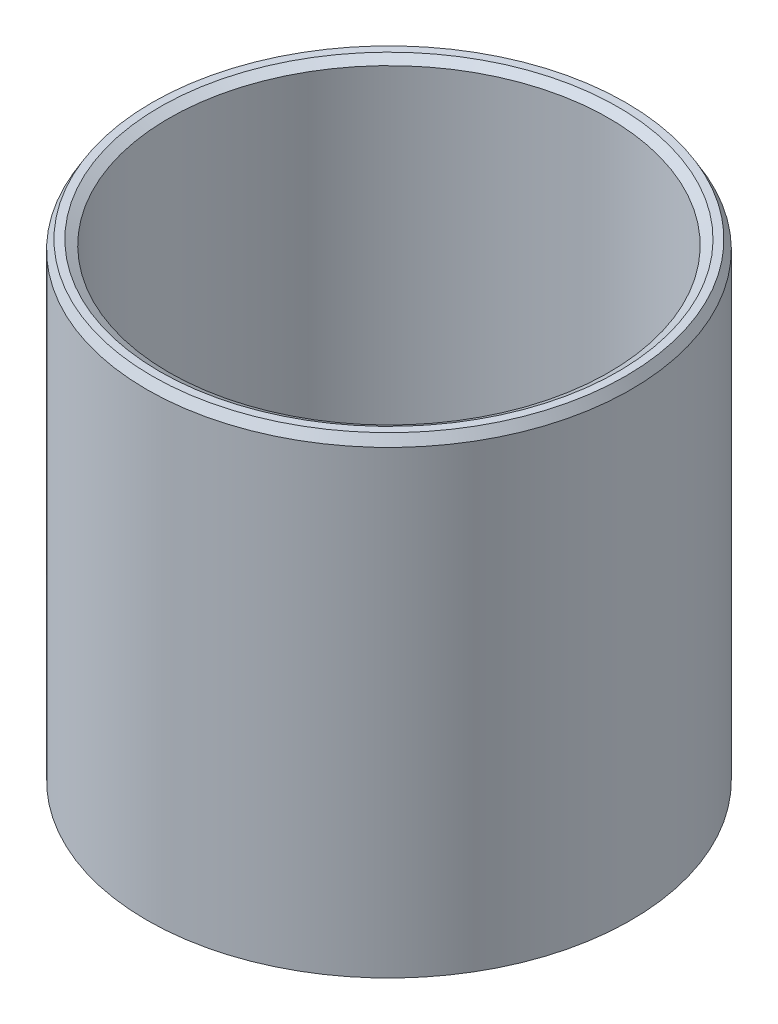
ISO-10303-21;
HEADER;
FILE_DESCRIPTION(('STEP AP214'),'2;1');
FILE_NAME('part.step','',(''),(''),'','','');
FILE_SCHEMA(('AUTOMOTIVE_DESIGN { 1 0 10303 214 1 1 1 1 }'));
ENDSEC;
DATA;
#1=APPLICATION_CONTEXT('core data for automotive mechanical design processes');
#2=APPLICATION_PROTOCOL_DEFINITION('international standard','automotive_design',2000,#1);
#3=PRODUCT_CONTEXT('',#1,'mechanical');
#4=PRODUCT('Part','Part','',(#3));
#5=PRODUCT_RELATED_PRODUCT_CATEGORY('part','',(#4));
#6=PRODUCT_DEFINITION_FORMATION('','',#4);
#7=PRODUCT_DEFINITION_CONTEXT('part definition',#1,'design');
#8=PRODUCT_DEFINITION('design','',#6,#7);
#9=PRODUCT_DEFINITION_SHAPE('','',#8);
#10=(LENGTH_UNIT() NAMED_UNIT(*) SI_UNIT(.MILLI.,.METRE.));
#11=(NAMED_UNIT(*) PLANE_ANGLE_UNIT() SI_UNIT($,.RADIAN.));
#12=(NAMED_UNIT(*) SI_UNIT($,.STERADIAN.) SOLID_ANGLE_UNIT());
#13=UNCERTAINTY_MEASURE_WITH_UNIT(LENGTH_MEASURE(1.E-05),#10,'distance_accuracy_value','');
#14=(GEOMETRIC_REPRESENTATION_CONTEXT(3) GLOBAL_UNCERTAINTY_ASSIGNED_CONTEXT((#13)) GLOBAL_UNIT_ASSIGNED_CONTEXT((#10,
#11,#12)) REPRESENTATION_CONTEXT('',''));
#15=CARTESIAN_POINT('',(0.,0.,0.));
#16=DIRECTION('',(0.,0.,1.));
#17=DIRECTION('',(1.,0.,0.));
#18=AXIS2_PLACEMENT_3D('',#15,#16,#17);
#19=CARTESIAN_POINT('',(0.,107.64032081435,0.));
#20=DIRECTION('',(0.,-1.,0.));
#21=DIRECTION('',(0.,0.,-1.));
#22=AXIS2_PLACEMENT_3D('',#19,#20,#21);
#23=CYLINDRICAL_SURFACE('',#22,55.);
#24=CARTESIAN_POINT('',(0.,1.1913957796432,0.));
#25=DIRECTION('',(0.,1.,0.));
#26=DIRECTION('',(0.,0.,1.));
#27=AXIS2_PLACEMENT_3D('',#24,#25,#26);
#28=CIRCLE('',#27,55.);
#29=CARTESIAN_POINT('',(0.,1.19139577964319,55.));
#30=VERTEX_POINT('',#29);
#31=EDGE_CURVE('E10',#30,#30,#28,.T.);
#32=ORIENTED_EDGE('',*,*,#31,.T.);
#33=EDGE_LOOP('',(#32));
#34=FACE_BOUND('',#33,.T.);
#35=CARTESIAN_POINT('',(0.,105.576762792085,0.));
#36=DIRECTION('',(0.,1.,0.));
#37=DIRECTION('',(0.,0.,1.));
#38=AXIS2_PLACEMENT_3D('',#35,#36,#37);
#39=CIRCLE('',#38,55.);
#40=CARTESIAN_POINT('',(0.,105.576762792085,55.));
#41=VERTEX_POINT('',#40);
#42=EDGE_CURVE('E50',#41,#41,#39,.F.);
#43=ORIENTED_EDGE('',*,*,#42,.T.);
#44=EDGE_LOOP('',(#43));
#45=FACE_BOUND('',#44,.T.);
#46=ADVANCED_FACE('F39',(#34,#45),#23,.T.);
#47=CARTESIAN_POINT('',(0.,107.64032081435,0.));
#48=DIRECTION('',(0.,1.,0.));
#49=DIRECTION('',(0.,0.,1.));
#50=AXIS2_PLACEMENT_3D('',#47,#48,#49);
#51=PLANE('',#50);
#52=CARTESIAN_POINT('',(0.,107.64032081435,0.));
#53=DIRECTION('',(0.,1.,0.));
#54=DIRECTION('',(0.,0.,1.));
#55=AXIS2_PLACEMENT_3D('',#52,#53,#54);
#56=CIRCLE('',#55,52.0592145502116);
#57=CARTESIAN_POINT('',(0.,107.64032081435,52.0592145502116));
#58=VERTEX_POINT('',#57);
#59=EDGE_CURVE('E58',#58,#58,#56,.F.);
#60=ORIENTED_EDGE('',*,*,#59,.T.);
#61=EDGE_LOOP('',(#60));
#62=FACE_BOUND('',#61,.T.);
#63=CARTESIAN_POINT('',(0.,107.64032081435,0.));
#64=DIRECTION('',(0.,1.,0.));
#65=DIRECTION('',(0.,0.,1.));
#66=AXIS2_PLACEMENT_3D('',#63,#64,#65);
#67=CIRCLE('',#66,53.8086042203568);
#68=CARTESIAN_POINT('',(0.,107.64032081435,53.8086042203568));
#69=VERTEX_POINT('',#68);
#70=EDGE_CURVE('E61',#69,#69,#67,.T.);
#71=ORIENTED_EDGE('',*,*,#70,.T.);
#72=EDGE_LOOP('',(#71));
#73=FACE_BOUND('',#72,.T.);
#74=ADVANCED_FACE('F88',(#62,#73),#51,.T.);
#75=CARTESIAN_POINT('',(0.,0.,0.));
#76=DIRECTION('',(0.,1.,0.));
#77=DIRECTION('',(0.,0.,1.));
#78=AXIS2_PLACEMENT_3D('',#75,#76,#77);
#79=PLANE('',#78);
#80=CARTESIAN_POINT('',(0.,0.,0.));
#81=DIRECTION('',(0.,1.,0.));
#82=DIRECTION('',(0.,0.,1.));
#83=AXIS2_PLACEMENT_3D('',#80,#81,#82);
#84=CIRCLE('',#83,51.1870523075897);
#85=CARTESIAN_POINT('',(0.,0.,51.1870523075897));
#86=VERTEX_POINT('',#85);
#87=EDGE_CURVE('E51',#86,#86,#84,.T.);
#88=ORIENTED_EDGE('',*,*,#87,.T.);
#89=EDGE_LOOP('',(#88));
#90=FACE_BOUND('',#89,.T.);
#91=CARTESIAN_POINT('',(0.,0.,0.));
#92=DIRECTION('',(0.,1.,0.));
#93=DIRECTION('',(0.,0.,1.));
#94=AXIS2_PLACEMENT_3D('',#91,#92,#93);
#95=CIRCLE('',#94,52.9364419777349);
#96=CARTESIAN_POINT('',(0.,0.,52.9364419777349));
#97=VERTEX_POINT('',#96);
#98=EDGE_CURVE('E54',#97,#97,#95,.F.);
#99=ORIENTED_EDGE('',*,*,#98,.T.);
#100=EDGE_LOOP('',(#99));
#101=FACE_BOUND('',#100,.T.);
#102=ADVANCED_FACE('F83',(#90,#101),#79,.F.);
#103=CARTESIAN_POINT('',(0.,107.64032081435,0.));
#104=DIRECTION('',(0.,-1.,0.));
#105=DIRECTION('',(0.,0.,-1.));
#106=AXIS2_PLACEMENT_3D('',#103,#104,#105);
#107=CYLINDRICAL_SURFACE('',#106,49.9956565279465);
#108=CARTESIAN_POINT('',(0.,106.448925034707,0.));
#109=DIRECTION('',(0.,1.,0.));
#110=DIRECTION('',(0.,0.,1.));
#111=AXIS2_PLACEMENT_3D('',#108,#109,#110);
#112=CIRCLE('',#111,49.9956565279465);
#113=CARTESIAN_POINT('',(0.,106.448925034707,49.9956565279465));
#114=VERTEX_POINT('',#113);
#115=EDGE_CURVE('E67',#114,#114,#112,.T.);
#116=ORIENTED_EDGE('',*,*,#115,.T.);
#117=EDGE_LOOP('',(#116));
#118=FACE_BOUND('',#117,.T.);
#119=CARTESIAN_POINT('',(0.,2.06355802226514,0.));
#120=DIRECTION('',(0.,1.,0.));
#121=DIRECTION('',(0.,0.,1.));
#122=AXIS2_PLACEMENT_3D('',#119,#120,#121);
#123=CIRCLE('',#122,49.9956565279465);
#124=CARTESIAN_POINT('',(0.,2.06355802226514,49.9956565279465));
#125=VERTEX_POINT('',#124);
#126=EDGE_CURVE('E69',#125,#125,#123,.F.);
#127=ORIENTED_EDGE('',*,*,#126,.T.);
#128=EDGE_LOOP('',(#127));
#129=FACE_BOUND('',#128,.T.);
#130=ADVANCED_FACE('F71',(#118,#129),#107,.F.);
#131=CARTESIAN_POINT('',(0.,106.448925034707,0.));
#132=DIRECTION('',(0.,1.,0.));
#133=DIRECTION('',(0.,0.,1.));
#134=AXIS2_PLACEMENT_3D('',#131,#132,#133);
#135=CONICAL_SURFACE('',#134,49.9956565279465,1.04719755119661);
#136=CARTESIAN_POINT('',(0.,107.64032081435,52.0592145502116));
#137=CARTESIAN_POINT('',(0.,107.627910441645,52.0377191541463));
#138=CARTESIAN_POINT('',(0.,107.615500068941,52.0162237580811));
#139=CARTESIAN_POINT('',(0.,107.590679323532,51.9732329659506));
#140=CARTESIAN_POINT('',(0.,107.578268950827,51.9517375698853));
#141=CARTESIAN_POINT('',(0.,107.553448205418,51.9087467777548));
#142=CARTESIAN_POINT('',(0.,107.541037832713,51.8872513816895));
#143=CARTESIAN_POINT('',(0.,107.516217087304,51.844260589559));
#144=CARTESIAN_POINT('',(0.,107.503806714599,51.8227651934937));
#145=CARTESIAN_POINT('',(0.,107.47898596919,51.7797744013632));
#146=CARTESIAN_POINT('',(0.,107.466575596485,51.758279005298));
#147=CARTESIAN_POINT('',(0.,107.441754851076,51.7152882131674));
#148=CARTESIAN_POINT('',(0.,107.429344478371,51.6937928171022));
#149=CARTESIAN_POINT('',(0.,107.404523732962,51.6508020249716));
#150=CARTESIAN_POINT('',(0.,107.392113360258,51.6293066289064));
#151=CARTESIAN_POINT('',(0.,107.367292614848,51.5863158367759));
#152=CARTESIAN_POINT('',(0.,107.354882242144,51.5648204407106));
#153=CARTESIAN_POINT('',(0.,107.330061496735,51.5218296485801));
#154=CARTESIAN_POINT('',(0.,107.31765112403,51.5003342525148));
#155=CARTESIAN_POINT('',(0.,107.292830378621,51.4573434603843));
#156=CARTESIAN_POINT('',(0.,107.280420005916,51.435848064319));
#157=CARTESIAN_POINT('',(0.,107.255599260507,51.3928572721885));
#158=CARTESIAN_POINT('',(0.,107.243188887802,51.3713618761232));
#159=CARTESIAN_POINT('',(0.,107.218368142393,51.3283710839927));
#160=CARTESIAN_POINT('',(0.,107.205957769688,51.3068756879275));
#161=CARTESIAN_POINT('',(0.,107.181137024279,51.2638848957969));
#162=CARTESIAN_POINT('',(0.,107.168726651575,51.2423894997317));
#163=CARTESIAN_POINT('',(0.,107.143905906165,51.1993987076011));
#164=CARTESIAN_POINT('',(0.,107.131495533461,51.1779033115359));
#165=CARTESIAN_POINT('',(0.,107.106674788051,51.1349125194054));
#166=CARTESIAN_POINT('',(0.,107.094264415347,51.1134171233401));
#167=CARTESIAN_POINT('',(0.,107.069443669938,51.0704263312096));
#168=CARTESIAN_POINT('',(0.,107.057033297233,51.0489309351443));
#169=CARTESIAN_POINT('',(0.,107.032212551824,51.0059401430138));
#170=CARTESIAN_POINT('',(0.,107.019802179119,50.9844447469485));
#171=CARTESIAN_POINT('',(0.,106.99498143371,50.941453954818));
#172=CARTESIAN_POINT('',(0.,106.982571061005,50.9199585587527));
#173=CARTESIAN_POINT('',(0.,106.957750315596,50.8769677666222));
#174=CARTESIAN_POINT('',(0.,106.945339942891,50.855472370557));
#175=CARTESIAN_POINT('',(0.,106.920519197482,50.8124815784264));
#176=CARTESIAN_POINT('',(0.,106.908108824778,50.7909861823612));
#177=CARTESIAN_POINT('',(0.,106.883288079368,50.7479953902307));
#178=CARTESIAN_POINT('',(0.,106.870877706664,50.7264999941654));
#179=CARTESIAN_POINT('',(0.,106.846056961255,50.6835092020349));
#180=CARTESIAN_POINT('',(0.,106.83364658855,50.6620138059696));
#181=CARTESIAN_POINT('',(0.,106.808825843141,50.6190230138391));
#182=CARTESIAN_POINT('',(0.,106.796415470436,50.5975276177738));
#183=CARTESIAN_POINT('',(0.,106.771594725027,50.5545368256433));
#184=CARTESIAN_POINT('',(0.,106.759184352322,50.533041429578));
#185=CARTESIAN_POINT('',(0.,106.734363606913,50.4900506374475));
#186=CARTESIAN_POINT('',(0.,106.721953234208,50.4685552413823));
#187=CARTESIAN_POINT('',(0.,106.697132488799,50.4255644492517));
#188=CARTESIAN_POINT('',(0.,106.684722116095,50.4040690531865));
#189=CARTESIAN_POINT('',(0.,106.659901370685,50.3610782610559));
#190=CARTESIAN_POINT('',(0.,106.647490997981,50.3395828649907));
#191=CARTESIAN_POINT('',(0.,106.622670252571,50.2965920728602));
#192=CARTESIAN_POINT('',(0.,106.610259879867,50.2750966767949));
#193=CARTESIAN_POINT('',(0.,106.585439134458,50.2321058846644));
#194=CARTESIAN_POINT('',(0.,106.573028761753,50.2106104885991));
#195=CARTESIAN_POINT('',(0.,106.548208016344,50.1676196964686));
#196=CARTESIAN_POINT('',(0.,106.535797643639,50.1461243004033));
#197=CARTESIAN_POINT('',(0.,106.51097689823,50.1031335082728));
#198=CARTESIAN_POINT('',(0.,106.498566525525,50.0816381122075));
#199=CARTESIAN_POINT('',(0.,106.473745780116,50.038647320077));
#200=CARTESIAN_POINT('',(0.,106.461335407411,50.0171519240118));
#201=CARTESIAN_POINT('',(0.,106.448925034707,49.9956565279465));
#202=B_SPLINE_CURVE_WITH_KNOTS('',3,(#136,#137,#138,#139,#140,#141,#142,#143,#144,#145,#146,
#147,#148,#149,#150,#151,#152,#153,#154,#155,#156,#157,#158,#159,#160,#161,#162,#163,#164,#165,
#166,#167,#168,#169,#170,#171,#172,#173,#174,#175,#176,#177,#178,#179,#180,#181,#182,#183,#184,
#185,#186,#187,#188,#189,#190,#191,#192,#193,#194,#195,#196,#197,#198,#199,#200,#201),
.UNSPECIFIED.,.F.,.F.,(4,2,2,2,2,2,2,2,2,2,2,2,2,2,2,2,2,2,2,2,2,2,2,2,2,2,2,2,2,2,2,2,4),(0.,
0.0744622362276958,0.148924472455398,0.223386708683093,0.297848944910795,0.372311181138491,
0.446773417366186,0.521235653593882,0.595697889821584,0.670160126049279,0.744622362276981,
0.819084598504676,0.893546834732372,0.968009070960074,1.04247130718777,1.11693354341547,
1.19139577964316,1.26585801587086,1.34032025209856,1.41478248832626,1.48924472455396,
1.56370696078166,1.63816919700935,1.71263143323705,1.78709366946474,1.86155590569245,
1.93601814192015,2.01048037814784,2.08494261437554,2.15940485060323,2.23386708683094,
2.30832932305863,2.38279155928633),.UNSPECIFIED.);
#203=EDGE_CURVE('BSEAM77',#58,#114,#202,.T.);
#204=ORIENTED_EDGE('',*,*,#59,.F.);
#205=ORIENTED_EDGE('',*,*,#115,.F.);
#206=ORIENTED_EDGE('',*,*,#203,.T.);
#207=ORIENTED_EDGE('',*,*,#203,.F.);
#208=EDGE_LOOP('',(#204,#206,#205,#207));
#209=FACE_BOUND('',#208,.T.);
#210=ADVANCED_FACE('F77',(#209),#135,.F.);
#211=CARTESIAN_POINT('',(0.,0.,0.));
#212=DIRECTION('',(0.,-1.,0.));
#213=DIRECTION('',(0.,0.,-1.));
#214=AXIS2_PLACEMENT_3D('',#211,#212,#213);
#215=CONICAL_SURFACE('',#214,51.1870523075897,0.523598775598298);
#216=ORIENTED_EDGE('',*,*,#126,.F.);
#217=EDGE_LOOP('',(#216));
#218=FACE_BOUND('',#217,.T.);
#219=ORIENTED_EDGE('',*,*,#87,.F.);
#220=EDGE_LOOP('',(#219));
#221=FACE_BOUND('',#220,.T.);
#222=ADVANCED_FACE('F73',(#218,#221),#215,.F.);
#223=CARTESIAN_POINT('',(0.,1.1913957796432,0.));
#224=DIRECTION('',(0.,1.,0.));
#225=DIRECTION('',(0.,0.,1.));
#226=AXIS2_PLACEMENT_3D('',#223,#224,#225);
#227=CONICAL_SURFACE('',#226,55.,1.0471975511966);
#228=CARTESIAN_POINT('',(0.,0.,52.9364419777349));
#229=CARTESIAN_POINT('',(0.,0.012410372704615,52.9579373738001));
#230=CARTESIAN_POINT('',(0.,0.0248207454092321,52.9794327698654));
#231=CARTESIAN_POINT('',(0.,0.0496414908184662,53.0224235619959));
#232=CARTESIAN_POINT('',(0.,0.0620518635230833,53.0439189580612));
#233=CARTESIAN_POINT('',(0.,0.0868726089323167,53.0869097501917));
#234=CARTESIAN_POINT('',(0.,0.099282981636933,53.108405146257));
#235=CARTESIAN_POINT('',(0.,0.124103727046166,53.1513959383875));
#236=CARTESIAN_POINT('',(0.,0.136514099750782,53.1728913344527));
#237=CARTESIAN_POINT('',(0.,0.161334845160015,53.2158821265833));
#238=CARTESIAN_POINT('',(0.,0.173745217864633,53.2373775226485));
#239=CARTESIAN_POINT('',(0.,0.198565963273866,53.280368314779));
#240=CARTESIAN_POINT('',(0.,0.210976335978483,53.3018637108443));
#241=CARTESIAN_POINT('',(0.,0.235797081387715,53.3448545029748));
#242=CARTESIAN_POINT('',(0.,0.248207454092331,53.3663498990401));
#243=CARTESIAN_POINT('',(0.,0.273028199501565,53.4093406911706));
#244=CARTESIAN_POINT('',(0.,0.285438572206182,53.4308360872359));
#245=CARTESIAN_POINT('',(0.,0.310259317615416,53.4738268793664));
#246=CARTESIAN_POINT('',(0.,0.322669690320032,53.4953222754317));
#247=CARTESIAN_POINT('',(0.,0.347490435729265,53.5383130675622));
#248=CARTESIAN_POINT('',(0.,0.359900808433881,53.5598084636275));
#249=CARTESIAN_POINT('',(0.,0.384721553843114,53.602799255758));
#250=CARTESIAN_POINT('',(0.,0.397131926547732,53.6242946518232));
#251=CARTESIAN_POINT('',(0.,0.421952671956965,53.6672854439538));
#252=CARTESIAN_POINT('',(0.,0.434363044661581,53.688780840019));
#253=CARTESIAN_POINT('',(0.,0.459183790070814,53.7317716321495));
#254=CARTESIAN_POINT('',(0.,0.471594162775431,53.7532670282148));
#255=CARTESIAN_POINT('',(0.,0.496414908184664,53.7962578203453));
#256=CARTESIAN_POINT('',(0.,0.50882528088928,53.8177532164106));
#257=CARTESIAN_POINT('',(0.,0.533646026298514,53.8607440085411));
#258=CARTESIAN_POINT('',(0.,0.546056399003131,53.8822394046064));
#259=CARTESIAN_POINT('',(0.,0.570877144412365,53.9252301967369));
#260=CARTESIAN_POINT('',(0.,0.583287517116981,53.9467255928022));
#261=CARTESIAN_POINT('',(0.,0.608108262526214,53.9897163849327));
#262=CARTESIAN_POINT('',(0.,0.62051863523083,54.011211780998));
#263=CARTESIAN_POINT('',(0.,0.645339380640063,54.0542025731285));
#264=CARTESIAN_POINT('',(0.,0.657749753344681,54.0756979691937));
#265=CARTESIAN_POINT('',(0.,0.682570498753914,54.1186887613243));
#266=CARTESIAN_POINT('',(0.,0.69498087145853,54.1401841573895));
#267=CARTESIAN_POINT('',(0.,0.719801616867763,54.18317494952));
#268=CARTESIAN_POINT('',(0.,0.732211989572379,54.2046703455853));
#269=CARTESIAN_POINT('',(0.,0.757032734981613,54.2476611377158));
#270=CARTESIAN_POINT('',(0.,0.76944310768623,54.2691565337811));
#271=CARTESIAN_POINT('',(0.,0.794263853095464,54.3121473259116));
#272=CARTESIAN_POINT('',(0.,0.80667422580008,54.3336427219769));
#273=CARTESIAN_POINT('',(0.,0.831494971209313,54.3766335141074));
#274=CARTESIAN_POINT('',(0.,0.843905343913929,54.3981289101727));
#275=CARTESIAN_POINT('',(0.,0.868726089323163,54.4411197023032));
#276=CARTESIAN_POINT('',(0.,0.88113646202778,54.4626150983685));
#277=CARTESIAN_POINT('',(0.,0.905957207437013,54.505605890499));
#278=CARTESIAN_POINT('',(0.,0.918367580141629,54.5271012865642));
#279=CARTESIAN_POINT('',(0.,0.943188325550863,54.5700920786948));
#280=CARTESIAN_POINT('',(0.,0.955598698255479,54.59158747476));
#281=CARTESIAN_POINT('',(0.,0.980419443664712,54.6345782668905));
#282=CARTESIAN_POINT('',(0.,0.992829816369328,54.6560736629558));
#283=CARTESIAN_POINT('',(0.,1.01765056177856,54.6990644550863));
#284=CARTESIAN_POINT('',(0.,1.03006093448318,54.7205598511516));
#285=CARTESIAN_POINT('',(0.,1.05488167989241,54.7635506432821));
#286=CARTESIAN_POINT('',(0.,1.06729205259703,54.7850460393474));
#287=CARTESIAN_POINT('',(0.,1.09211279800626,54.8280368314779));
#288=CARTESIAN_POINT('',(0.,1.10452317071088,54.8495322275432));
#289=CARTESIAN_POINT('',(0.,1.12934391612011,54.8925230196737));
#290=CARTESIAN_POINT('',(0.,1.14175428882473,54.914018415739));
#291=CARTESIAN_POINT('',(0.,1.16657503423396,54.9570092078695));
#292=CARTESIAN_POINT('',(0.,1.17898540693858,54.9785046039347));
#293=CARTESIAN_POINT('',(0.,1.19139577964319,55.));
#294=B_SPLINE_CURVE_WITH_KNOTS('',3,(#228,#229,#230,#231,#232,#233,#234,#235,#236,#237,#238,
#239,#240,#241,#242,#243,#244,#245,#246,#247,#248,#249,#250,#251,#252,#253,#254,#255,#256,#257,
#258,#259,#260,#261,#262,#263,#264,#265,#266,#267,#268,#269,#270,#271,#272,#273,#274,#275,#276,
#277,#278,#279,#280,#281,#282,#283,#284,#285,#286,#287,#288,#289,#290,#291,#292,#293),
.UNSPECIFIED.,.F.,.F.,(4,2,2,2,2,2,2,2,2,2,2,2,2,2,2,2,2,2,2,2,2,2,2,2,2,2,2,2,2,2,2,2,4),(0.,
0.0744622362277014,0.148924472455397,0.223386708683098,0.2978489449108,0.372311181138495,
0.446773417366196,0.521235653593898,0.595697889821593,0.670160126049294,0.744622362276996,
0.819084598504691,0.893546834732393,0.968009070960094,1.0424713071878,1.11693354341549,
1.19139577964319,1.26585801587089,1.34032025209859,1.41478248832629,1.48924472455399,
1.56370696078169,1.63816919700939,1.71263143323709,1.78709366946479,1.86155590569249,
1.93601814192019,2.01048037814789,2.08494261437558,2.15940485060329,2.23386708683099,
2.30832932305868,2.38279155928638),.UNSPECIFIED.);
#295=EDGE_CURVE('BSEAM76',#97,#30,#294,.T.);
#296=ORIENTED_EDGE('',*,*,#98,.F.);
#297=ORIENTED_EDGE('',*,*,#31,.F.);
#298=ORIENTED_EDGE('',*,*,#295,.T.);
#299=ORIENTED_EDGE('',*,*,#295,.F.);
#300=EDGE_LOOP('',(#296,#298,#297,#299));
#301=FACE_BOUND('',#300,.T.);
#302=ADVANCED_FACE('F76',(#301),#227,.T.);
#303=CARTESIAN_POINT('',(0.,107.64032081435,0.));
#304=DIRECTION('',(0.,-1.,0.));
#305=DIRECTION('',(0.,0.,-1.));
#306=AXIS2_PLACEMENT_3D('',#303,#304,#305);
#307=CONICAL_SURFACE('',#306,53.8086042203568,0.523598775598302);
#308=ORIENTED_EDGE('',*,*,#42,.F.);
#309=EDGE_LOOP('',(#308));
#310=FACE_BOUND('',#309,.T.);
#311=ORIENTED_EDGE('',*,*,#70,.F.);
#312=EDGE_LOOP('',(#311));
#313=FACE_BOUND('',#312,.T.);
#314=ADVANCED_FACE('F45',(#310,#313),#307,.T.);
#315=CLOSED_SHELL('',(#46,#74,#102,#130,#210,#222,#302,#314));
#316=MANIFOLD_SOLID_BREP('B2',#315);
#317=ADVANCED_BREP_SHAPE_REPRESENTATION('',(#18,#316),#14);
#318=SHAPE_DEFINITION_REPRESENTATION(#9,#317);
ENDSEC;
END-ISO-10303-21;
